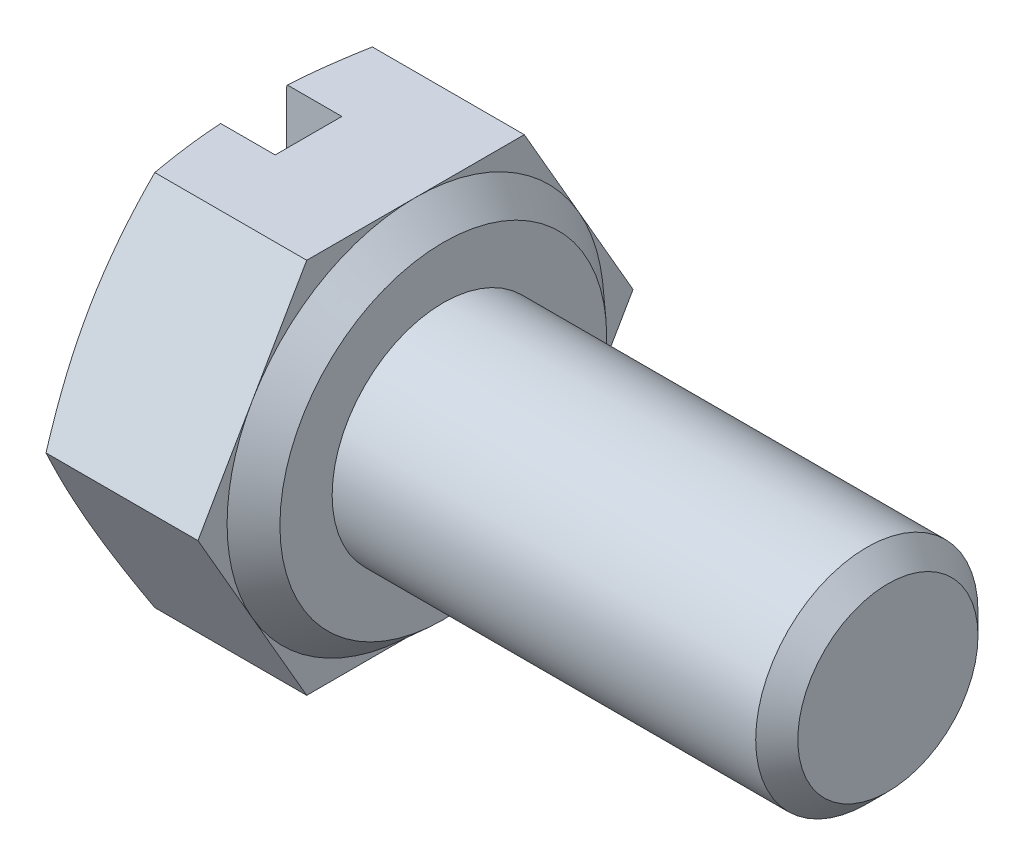
ISO-10303-21;
HEADER;
FILE_DESCRIPTION(('STEP AP214'),'2;1');
FILE_NAME('part.step','',(''),(''),'','','');
FILE_SCHEMA(('AUTOMOTIVE_DESIGN { 1 0 10303 214 1 1 1 1 }'));
ENDSEC;
DATA;
#1=APPLICATION_CONTEXT('core data for automotive mechanical design processes');
#2=APPLICATION_PROTOCOL_DEFINITION('international standard','automotive_design',2000,#1);
#3=PRODUCT_CONTEXT('',#1,'mechanical');
#4=PRODUCT('Part','Part','',(#3));
#5=PRODUCT_RELATED_PRODUCT_CATEGORY('part','',(#4));
#6=PRODUCT_DEFINITION_FORMATION('','',#4);
#7=PRODUCT_DEFINITION_CONTEXT('part definition',#1,'design');
#8=PRODUCT_DEFINITION('design','',#6,#7);
#9=PRODUCT_DEFINITION_SHAPE('','',#8);
#10=(LENGTH_UNIT() NAMED_UNIT(*) SI_UNIT(.MILLI.,.METRE.));
#11=(NAMED_UNIT(*) PLANE_ANGLE_UNIT() SI_UNIT($,.RADIAN.));
#12=(NAMED_UNIT(*) SI_UNIT($,.STERADIAN.) SOLID_ANGLE_UNIT());
#13=UNCERTAINTY_MEASURE_WITH_UNIT(LENGTH_MEASURE(1.E-05),#10,'distance_accuracy_value','');
#14=(GEOMETRIC_REPRESENTATION_CONTEXT(3) GLOBAL_UNCERTAINTY_ASSIGNED_CONTEXT((#13)) GLOBAL_UNIT_ASSIGNED_CONTEXT((#10,
#11,#12)) REPRESENTATION_CONTEXT('',''));
#15=CARTESIAN_POINT('',(0.,0.,0.));
#16=DIRECTION('',(0.,0.,1.));
#17=DIRECTION('',(1.,0.,0.));
#18=AXIS2_PLACEMENT_3D('',#15,#16,#17);
#19=CARTESIAN_POINT('',(0.,-3.39,-1.95721741255283));
#20=DIRECTION('',(1.,0.,0.));
#21=DIRECTION('',(0.,0.,-1.));
#22=AXIS2_PLACEMENT_3D('',#19,#20,#21);
#23=PLANE('',#22);
#24=CARTESIAN_POINT('',(0.,0.,0.));
#25=DIRECTION('',(1.,0.,0.));
#26=DIRECTION('',(0.,0.,-1.));
#27=AXIS2_PLACEMENT_3D('',#24,#25,#26);
#28=CIRCLE('',#27,3.39000000000002);
#29=CARTESIAN_POINT('',(0.,-3.33648018126889,-0.6));
#30=VERTEX_POINT('',#29);
#31=CARTESIAN_POINT('',(0.,-1.69500000000001,-2.93582611882924));
#32=VERTEX_POINT('',#31);
#33=EDGE_CURVE('E312',#30,#32,#28,.T.);
#34=ORIENTED_EDGE('',*,*,#33,.F.);
#35=DIRECTION('',(0.,1.,0.));
#36=VECTOR('',#35,1.);
#37=CARTESIAN_POINT('',(0.,-3.39,-0.6));
#38=LINE('',#37,#36);
#39=CARTESIAN_POINT('',(0.,3.33648018126889,-0.6));
#40=VERTEX_POINT('',#39);
#41=EDGE_CURVE('E11',#30,#40,#38,.T.);
#42=ORIENTED_EDGE('',*,*,#41,.T.);
#43=CARTESIAN_POINT('',(0.,1.69500000000001,-2.93582611882924));
#44=VERTEX_POINT('',#43);
#45=EDGE_CURVE('E310',#44,#40,#28,.T.);
#46=ORIENTED_EDGE('',*,*,#45,.F.);
#47=EDGE_CURVE('E318',#32,#44,#28,.T.);
#48=ORIENTED_EDGE('',*,*,#47,.F.);
#49=EDGE_LOOP('',(#34,#42,#46,#48));
#50=FACE_BOUND('',#49,.T.);
#51=ADVANCED_FACE('F37',(#50),#23,.F.);
#52=CARTESIAN_POINT('',(2.925,-3.39,1.95721741255283));
#53=DIRECTION('',(0.,1.,0.));
#54=DIRECTION('',(0.,0.,1.));
#55=AXIS2_PLACEMENT_3D('',#52,#53,#54);
#56=PLANE('',#55);
#57=DIRECTION('',(0.,0.,-1.));
#58=VECTOR('',#57,1.);
#59=CARTESIAN_POINT('',(1.,-3.39000000000004,0.6));
#60=LINE('',#59,#58);
#61=CARTESIAN_POINT('',(1.,-3.39000000000004,0.6));
#62=VERTEX_POINT('',#61);
#63=CARTESIAN_POINT('',(1.,-3.39000000000004,-0.6));
#64=VERTEX_POINT('',#63);
#65=EDGE_CURVE('E174',#62,#64,#60,.T.);
#66=ORIENTED_EDGE('',*,*,#65,.T.);
#67=DIRECTION('',(-1.,0.,0.));
#68=VECTOR('',#67,1.);
#69=CARTESIAN_POINT('',(1.,-3.39000000000004,-0.6));
#70=LINE('',#69,#68);
#71=CARTESIAN_POINT('',(0.0191768285320485,-3.39000000000004,-0.6));
#72=VERTEX_POINT('',#71);
#73=EDGE_CURVE('E180',#64,#72,#70,.T.);
#74=ORIENTED_EDGE('',*,*,#73,.T.);
#75=CARTESIAN_POINT('',(1.0199798935476,-3.39,-5.18202350349093));
#76=CARTESIAN_POINT('',(0.973277002242215,-3.39,-5.02864764339972));
#77=CARTESIAN_POINT('',(0.927119072876947,-3.39,-4.87510275748852));
#78=CARTESIAN_POINT('',(0.836194610175305,-3.39,-4.56758888202956));
#79=CARTESIAN_POINT('',(0.791428186940748,-3.39,-4.41361985996636));
#80=CARTESIAN_POINT('',(0.703513740136752,-3.39,-4.1049081257591));
#81=CARTESIAN_POINT('',(0.660368891930332,-3.39,-3.9501645060724));
#82=CARTESIAN_POINT('',(0.576202703755948,-3.39,-3.64010163790346));
#83=CARTESIAN_POINT('',(0.535181325660589,-3.39,-3.48478239981027));
#84=CARTESIAN_POINT('',(0.456277437117916,-3.39,-3.17538416295869));
#85=CARTESIAN_POINT('',(0.418362460953622,-3.39,-3.02131348495736));
#86=CARTESIAN_POINT('',(0.345760478621677,-3.39,-2.71240531015016));
#87=CARTESIAN_POINT('',(0.31107352977889,-3.39,-2.55756779977793));
#88=CARTESIAN_POINT('',(0.245736727919532,-3.39,-2.24709331546656));
#89=CARTESIAN_POINT('',(0.215085449738308,-3.39,-2.09145664402713));
#90=CARTESIAN_POINT('',(0.158752150984605,-3.39,-1.7792761387277));
#91=CARTESIAN_POINT('',(0.133070078323603,-3.39,-1.62273231439442));
#92=CARTESIAN_POINT('',(0.0902615531817793,-3.39,-1.32636320569982));
#93=CARTESIAN_POINT('',(0.0724987882413159,-3.39,-1.18663069691262));
#94=CARTESIAN_POINT('',(0.0424324881028078,-3.39,-0.906588669661413));
#95=CARTESIAN_POINT('',(0.0301282534946746,-3.39,-0.766279227447356));
#96=CARTESIAN_POINT('',(0.0115684693108612,-3.39,-0.485347204994709));
#97=CARTESIAN_POINT('',(0.0053089398892289,-3.39,-0.344724891973994));
#98=CARTESIAN_POINT('',(-0.000843430608769452,-3.39,-0.0633395865578644));
#99=CARTESIAN_POINT('',(-0.000736316645797419,-3.39,0.0774234048370721));
#100=CARTESIAN_POINT('',(0.00585535977489844,-3.39,0.359511810579499));
#101=CARTESIAN_POINT('',(0.0123722627973839,-3.39,0.500836456802881));
#102=CARTESIAN_POINT('',(0.0314839573460896,-3.39,0.783070507641816));
#103=CARTESIAN_POINT('',(0.0440788948926778,-3.39,0.923979902199419));
#104=CARTESIAN_POINT('',(0.0747561661274467,-3.39,1.20531451424878));
#105=CARTESIAN_POINT('',(0.0928432130380131,-3.39,1.34573921068273));
#106=CARTESIAN_POINT('',(0.133775937021095,-3.39,1.62588419860851));
#107=CARTESIAN_POINT('',(0.156621639598417,-3.39,1.76560448632082));
#108=CARTESIAN_POINT('',(0.233780310562563,-3.39,2.19842531997452));
#109=CARTESIAN_POINT('',(0.294955955630487,-3.39,2.49029899907323));
#110=CARTESIAN_POINT('',(0.429080881996306,-3.39,3.07133579793216));
#111=CARTESIAN_POINT('',(0.502034403900256,-3.39,3.36049790156761));
#112=CARTESIAN_POINT('',(0.655790287789285,-3.39,3.93710836070669));
#113=CARTESIAN_POINT('',(0.736602683097888,-3.39,4.22455401473235));
#114=CARTESIAN_POINT('',(0.903426263150155,-3.39,4.7978679479515));
#115=CARTESIAN_POINT('',(0.989436623009939,-3.39,5.08373646960918));
#116=CARTESIAN_POINT('',(1.1640850839713,-3.39,5.65121216000974));
#117=CARTESIAN_POINT('',(1.25268370134973,-3.39,5.93283153633285));
#118=CARTESIAN_POINT('',(1.43239756302465,-3.39,6.49527837196229));
#119=CARTESIAN_POINT('',(1.52351292806605,-3.39,6.77610579255846));
#120=CARTESIAN_POINT('',(1.70722886302288,-3.39,7.33609287888207));
#121=CARTESIAN_POINT('',(1.79982248576516,-3.39,7.6152548295592));
#122=CARTESIAN_POINT('',(1.98639802369661,-3.39,8.17308924398154));
#123=CARTESIAN_POINT('',(2.08037982391117,-3.39,8.45176174614945));
#124=CARTESIAN_POINT('',(2.17484728105454,-3.39,8.73026714408878));
#125=B_SPLINE_CURVE_WITH_KNOTS('',3,(#75,#76,#77,#78,#79,#80,#81,#82,#83,#84,#85,#86,#87,#88,
#89,#90,#91,#92,#93,#94,#95,#96,#97,#98,#99,#100,#101,#102,#103,#104,#105,#106,#107,#108,#109,
#110,#111,#112,#113,#114,#115,#116,#117,#118,#119,#120,#121,#122,#123,#124),.UNSPECIFIED.,.F.,
.F.,(4,2,2,2,2,2,2,2,2,2,2,2,2,2,2,2,2,2,2,2,2,2,2,2,4),(0.,0.480989717785644,0.962017397120821,
1.44394255408912,1.92585905497698,2.40183354492129,2.87781648583752,3.35363088376765,
3.82944029381557,4.25191845933479,4.67434247641531,5.09648817867019,5.51863089977051,
5.94291452361966,6.36720834108241,6.79186731337202,7.21652856175053,8.11074113208823,
9.00527638324546,9.90096905563466,10.7965199586566,11.6821858830082,12.5678943726271,
13.4502421784021,14.3325173097535),.UNSPECIFIED.);
#126=CARTESIAN_POINT('',(0.19087866615106,-3.39000000000001,-1.95721741255282));
#127=VERTEX_POINT('',#126);
#128=EDGE_CURVE('E391',#127,#72,#125,.T.);
#129=ORIENTED_EDGE('',*,*,#128,.F.);
#130=DIRECTION('',(-1.,0.,0.));
#131=VECTOR('',#130,1.);
#132=CARTESIAN_POINT('',(2.925,-3.39,-1.95721741255283));
#133=LINE('',#132,#131);
#134=CARTESIAN_POINT('',(2.925,-3.39,-1.95721741255283));
#135=VERTEX_POINT('',#134);
#136=EDGE_CURVE('E332',#135,#127,#133,.T.);
#137=ORIENTED_EDGE('',*,*,#136,.F.);
#138=DIRECTION('',(0.,0.,-1.));
#139=VECTOR('',#138,1.);
#140=CARTESIAN_POINT('',(2.925,-3.39,1.95721741255283));
#141=LINE('',#140,#139);
#142=CARTESIAN_POINT('',(2.925,-3.39,0.));
#143=VERTEX_POINT('',#142);
#144=EDGE_CURVE('E373',#143,#135,#141,.T.);
#145=ORIENTED_EDGE('',*,*,#144,.F.);
#146=CARTESIAN_POINT('',(2.925,-3.39,1.95721741255283));
#147=VERTEX_POINT('',#146);
#148=EDGE_CURVE('E370',#147,#143,#141,.T.);
#149=ORIENTED_EDGE('',*,*,#148,.F.);
#150=DIRECTION('',(-1.,0.,0.));
#151=VECTOR('',#150,1.);
#152=CARTESIAN_POINT('',(2.925,-3.39,1.95721741255283));
#153=LINE('',#152,#151);
#154=CARTESIAN_POINT('',(0.19087866615106,-3.39000000000004,1.95721741255281));
#155=VERTEX_POINT('',#154);
#156=EDGE_CURVE('E348',#147,#155,#153,.T.);
#157=ORIENTED_EDGE('',*,*,#156,.T.);
#158=CARTESIAN_POINT('',(0.0191768285320465,-3.39000000000004,0.6));
#159=VERTEX_POINT('',#158);
#160=EDGE_CURVE('E266',#159,#155,#125,.T.);
#161=ORIENTED_EDGE('',*,*,#160,.F.);
#162=DIRECTION('',(1.,0.,0.));
#163=VECTOR('',#162,1.);
#164=CARTESIAN_POINT('',(0.,-3.39000000000004,0.6));
#165=LINE('',#164,#163);
#166=EDGE_CURVE('E183',#159,#62,#165,.T.);
#167=ORIENTED_EDGE('',*,*,#166,.T.);
#168=EDGE_LOOP('',(#66,#74,#129,#137,#145,#149,#157,#161,#167));
#169=FACE_BOUND('',#168,.T.);
#170=ADVANCED_FACE('F283',(#169),#56,.F.);
#171=CARTESIAN_POINT('',(2.925,-3.39,-1.95721741255283));
#172=DIRECTION('',(0.,0.5,0.866025403784439));
#173=DIRECTION('',(0.,-0.866025403784439,0.5));
#174=AXIS2_PLACEMENT_3D('',#171,#172,#173);
#175=PLANE('',#174);
#176=CARTESIAN_POINT('',(0.190920695673182,0.000200000000001929,-3.9145502951595));
#177=CARTESIAN_POINT('',(0.161404170530895,-0.140203810950532,-3.83348811711196));
#178=CARTESIAN_POINT('',(0.134553686064012,-0.281070641113374,-3.75215861479756));
#179=CARTESIAN_POINT('',(0.0873142945927185,-0.563720316746573,-3.58897074848437));
#180=CARTESIAN_POINT('',(0.0669304448507107,-0.705503791101429,-3.50711202139895));
#181=CARTESIAN_POINT('',(0.0339601092717287,-0.988413133098568,-3.34377423664064));
#182=CARTESIAN_POINT('',(0.0213017035221379,-1.12953253845124,-3.2622989099724));
#183=CARTESIAN_POINT('',(0.00432321252371425,-1.41210139168608,-3.09915770649266));
#184=CARTESIAN_POINT('',(0.,-1.55355069584304,-3.01749191266095));
#185=CARTESIAN_POINT('',(0.,-1.83644930415696,-2.85416032499754));
#186=CARTESIAN_POINT('',(0.00432321252371371,-1.97789860831391,-2.77249453116584));
#187=CARTESIAN_POINT('',(0.0213017035221368,-2.26046746154876,-2.6093533276861));
#188=CARTESIAN_POINT('',(0.0339601092717272,-2.40158686690143,-2.52787800101785));
#189=CARTESIAN_POINT('',(0.0669304448507088,-2.68449620889857,-2.36454021625954));
#190=CARTESIAN_POINT('',(0.0873142945927163,-2.82627968325342,-2.28268148917413));
#191=CARTESIAN_POINT('',(0.13455368606401,-3.10892935888662,-2.11949362286094));
#192=CARTESIAN_POINT('',(0.161404170530892,-3.24979618904946,-2.03816412054653));
#193=CARTESIAN_POINT('',(0.190920695673179,-3.3902,-1.95710194249899));
#194=B_SPLINE_CURVE_WITH_KNOTS('',3,(#176,#177,#178,#179,#180,#181,#182,#183,#184,#185,#186,
#187,#188,#189,#190,#191,#192,#193),.UNSPECIFIED.,.F.,.F.,(4,2,2,2,2,2,2,2,4),(0.,
0.494419076649432,0.989223868307329,1.47934907283627,1.96929035184584,2.45923163085541,
2.94935683538435,3.44416162704224,3.93858070369168),.UNSPECIFIED.);
#195=CARTESIAN_POINT('',(0.190878666151059,0.,-3.91443482510566));
#196=VERTEX_POINT('',#195);
#197=EDGE_CURVE('E274',#196,#32,#194,.T.);
#198=ORIENTED_EDGE('',*,*,#197,.F.);
#199=DIRECTION('',(-1.,0.,0.));
#200=VECTOR('',#199,1.);
#201=CARTESIAN_POINT('',(2.925,0.,-3.91443482510566));
#202=LINE('',#201,#200);
#203=CARTESIAN_POINT('',(2.925,0.,-3.91443482510566));
#204=VERTEX_POINT('',#203);
#205=EDGE_CURVE('E336',#204,#196,#202,.T.);
#206=ORIENTED_EDGE('',*,*,#205,.F.);
#207=DIRECTION('',(0.,0.866025403784439,-0.5));
#208=VECTOR('',#207,1.);
#209=CARTESIAN_POINT('',(2.925,-3.39,-1.95721741255283));
#210=LINE('',#209,#208);
#211=CARTESIAN_POINT('',(2.925,-1.695,-2.93582611882923));
#212=VERTEX_POINT('',#211);
#213=EDGE_CURVE('E369',#212,#204,#210,.T.);
#214=ORIENTED_EDGE('',*,*,#213,.F.);
#215=EDGE_CURVE('E366',#135,#212,#210,.T.);
#216=ORIENTED_EDGE('',*,*,#215,.F.);
#217=ORIENTED_EDGE('',*,*,#136,.T.);
#218=EDGE_CURVE('E263',#32,#127,#194,.T.);
#219=ORIENTED_EDGE('',*,*,#218,.F.);
#220=EDGE_LOOP('',(#198,#206,#214,#216,#217,#219));
#221=FACE_BOUND('',#220,.T.);
#222=ADVANCED_FACE('F280',(#221),#175,.F.);
#223=CARTESIAN_POINT('',(2.925,0.,-3.91443482510566));
#224=DIRECTION('',(0.,-0.5,0.866025403784438));
#225=DIRECTION('',(0.,-0.866025403784438,-0.5));
#226=AXIS2_PLACEMENT_3D('',#223,#224,#225);
#227=PLANE('',#226);
#228=CARTESIAN_POINT('',(0.190920695673179,3.3902,-1.95710194249899));
#229=CARTESIAN_POINT('',(0.161404170530892,3.24979618904947,-2.03816412054653));
#230=CARTESIAN_POINT('',(0.13455368606401,3.10892935888663,-2.11949362286094));
#231=CARTESIAN_POINT('',(0.0873142945927164,2.82627968325343,-2.28268148917413));
#232=CARTESIAN_POINT('',(0.0669304448507088,2.68449620889857,-2.36454021625954));
#233=CARTESIAN_POINT('',(0.0339601092717272,2.40158686690143,-2.52787800101785));
#234=CARTESIAN_POINT('',(0.0213017035221369,2.26046746154876,-2.6093533276861));
#235=CARTESIAN_POINT('',(0.00432321252371387,1.97789860831392,-2.77249453116584));
#236=CARTESIAN_POINT('',(0.,1.83644930415696,-2.85416032499754));
#237=CARTESIAN_POINT('',(0.,1.55355069584304,-3.01749191266095));
#238=CARTESIAN_POINT('',(0.00432321252371453,1.41210139168609,-3.09915770649266));
#239=CARTESIAN_POINT('',(0.0213017035221382,1.12953253845124,-3.2622989099724));
#240=CARTESIAN_POINT('',(0.0339601092717288,0.988413133098571,-3.34377423664064));
#241=CARTESIAN_POINT('',(0.0669304448507108,0.705503791101433,-3.50711202139895));
#242=CARTESIAN_POINT('',(0.0873142945927185,0.563720316746576,-3.58897074848437));
#243=CARTESIAN_POINT('',(0.134553686064012,0.281070641113378,-3.75215861479756));
#244=CARTESIAN_POINT('',(0.161404170530895,0.140203810950536,-3.83348811711196));
#245=CARTESIAN_POINT('',(0.190920695673182,-0.000199999999998229,-3.9145502951595));
#246=B_SPLINE_CURVE_WITH_KNOTS('',3,(#228,#229,#230,#231,#232,#233,#234,#235,#236,#237,#238,
#239,#240,#241,#242,#243,#244,#245),.UNSPECIFIED.,.F.,.F.,(4,2,2,2,2,2,2,2,4),(0.,
0.494419076649432,0.98922386830733,1.47934907283627,1.96929035184584,2.45923163085541,
2.94935683538435,3.44416162704224,3.93858070369168),.UNSPECIFIED.);
#247=CARTESIAN_POINT('',(0.19087866615106,3.39,-1.95721741255285));
#248=VERTEX_POINT('',#247);
#249=EDGE_CURVE('E314',#248,#44,#246,.T.);
#250=ORIENTED_EDGE('',*,*,#249,.F.);
#251=DIRECTION('',(-1.,0.,0.));
#252=VECTOR('',#251,1.);
#253=CARTESIAN_POINT('',(2.925,3.39,-1.95721741255283));
#254=LINE('',#253,#252);
#255=CARTESIAN_POINT('',(2.925,3.39,-1.95721741255283));
#256=VERTEX_POINT('',#255);
#257=EDGE_CURVE('E339',#256,#248,#254,.T.);
#258=ORIENTED_EDGE('',*,*,#257,.F.);
#259=DIRECTION('',(0.,0.866025403784438,0.5));
#260=VECTOR('',#259,1.);
#261=CARTESIAN_POINT('',(2.925,0.,-3.91443482510566));
#262=LINE('',#261,#260);
#263=CARTESIAN_POINT('',(2.925,1.695,-2.93582611882923));
#264=VERTEX_POINT('',#263);
#265=EDGE_CURVE('E365',#264,#256,#262,.T.);
#266=ORIENTED_EDGE('',*,*,#265,.F.);
#267=EDGE_CURVE('E362',#204,#264,#262,.T.);
#268=ORIENTED_EDGE('',*,*,#267,.F.);
#269=ORIENTED_EDGE('',*,*,#205,.T.);
#270=EDGE_CURVE('E275',#44,#196,#246,.T.);
#271=ORIENTED_EDGE('',*,*,#270,.F.);
#272=EDGE_LOOP('',(#250,#258,#266,#268,#269,#271));
#273=FACE_BOUND('',#272,.T.);
#274=ADVANCED_FACE('F254',(#273),#227,.F.);
#275=CARTESIAN_POINT('',(2.925,3.39,-1.95721741255283));
#276=DIRECTION('',(0.,-1.,0.));
#277=DIRECTION('',(0.,0.,-1.));
#278=AXIS2_PLACEMENT_3D('',#275,#276,#277);
#279=PLANE('',#278);
#280=CARTESIAN_POINT('',(1.0199798935476,3.39,-5.18202350349093));
#281=CARTESIAN_POINT('',(0.973277002242215,3.39,-5.02864764339972));
#282=CARTESIAN_POINT('',(0.927119072876947,3.39,-4.87510275748851));
#283=CARTESIAN_POINT('',(0.836194610175304,3.39,-4.56758888202956));
#284=CARTESIAN_POINT('',(0.791428186940747,3.39,-4.41361985996636));
#285=CARTESIAN_POINT('',(0.703513740136751,3.39,-4.1049081257591));
#286=CARTESIAN_POINT('',(0.660368891930331,3.39,-3.9501645060724));
#287=CARTESIAN_POINT('',(0.576202703755947,3.39,-3.64010163790345));
#288=CARTESIAN_POINT('',(0.535181325660588,3.39,-3.48478239981026));
#289=CARTESIAN_POINT('',(0.456277437117916,3.39,-3.17538416295869));
#290=CARTESIAN_POINT('',(0.418362460953622,3.39,-3.02131348495735));
#291=CARTESIAN_POINT('',(0.345760478621677,3.39,-2.71240531015016));
#292=CARTESIAN_POINT('',(0.31107352977889,3.39,-2.55756779977793));
#293=CARTESIAN_POINT('',(0.245736727919532,3.39,-2.24709331546656));
#294=CARTESIAN_POINT('',(0.215085449738308,3.39,-2.09145664402713));
#295=CARTESIAN_POINT('',(0.158752150984605,3.39,-1.7792761387277));
#296=CARTESIAN_POINT('',(0.133070078323604,3.39,-1.62273231439442));
#297=CARTESIAN_POINT('',(0.0902615531817794,3.39,-1.32636320569982));
#298=CARTESIAN_POINT('',(0.072498788241316,3.39,-1.18663069691261));
#299=CARTESIAN_POINT('',(0.0424324881028079,3.39,-0.90658866966141));
#300=CARTESIAN_POINT('',(0.0301282534946748,3.39,-0.766279227447353));
#301=CARTESIAN_POINT('',(0.0115684693108616,3.39,-0.485347204994706));
#302=CARTESIAN_POINT('',(0.00530893988922932,3.39,-0.344724891973991));
#303=CARTESIAN_POINT('',(-0.000843430608769069,3.39,-0.0633395865578616));
#304=CARTESIAN_POINT('',(-0.000736316645797097,3.39,0.077423404837075));
#305=CARTESIAN_POINT('',(0.00585535977489889,3.39,0.359511810579502));
#306=CARTESIAN_POINT('',(0.0123722627973845,3.39,0.500836456802884));
#307=CARTESIAN_POINT('',(0.0314839573460904,3.39,0.783070507641819));
#308=CARTESIAN_POINT('',(0.0440788948926785,3.39,0.923979902199422));
#309=CARTESIAN_POINT('',(0.0747561661274475,3.39,1.20531451424878));
#310=CARTESIAN_POINT('',(0.0928432130380141,3.39,1.34573921068274));
#311=CARTESIAN_POINT('',(0.133775937021096,3.39,1.62588419860851));
#312=CARTESIAN_POINT('',(0.156621639598417,3.39,1.76560448632083));
#313=CARTESIAN_POINT('',(0.233780310562564,3.39,2.19842531997453));
#314=CARTESIAN_POINT('',(0.294955955630488,3.39,2.49029899907324));
#315=CARTESIAN_POINT('',(0.429080881996308,3.39,3.07133579793217));
#316=CARTESIAN_POINT('',(0.502034403900258,3.39,3.36049790156762));
#317=CARTESIAN_POINT('',(0.655790287789287,3.39,3.9371083607067));
#318=CARTESIAN_POINT('',(0.73660268309789,3.39,4.22455401473236));
#319=CARTESIAN_POINT('',(0.903426263150158,3.39,4.79786794795151));
#320=CARTESIAN_POINT('',(0.989436623009942,3.39,5.08373646960919));
#321=CARTESIAN_POINT('',(1.1640850839713,3.39,5.65121216000975));
#322=CARTESIAN_POINT('',(1.25268370134973,3.39,5.93283153633286));
#323=CARTESIAN_POINT('',(1.43239756302465,3.39,6.4952783719623));
#324=CARTESIAN_POINT('',(1.52351292806605,3.39,6.77610579255847));
#325=CARTESIAN_POINT('',(1.70722886302288,3.39,7.33609287888208));
#326=CARTESIAN_POINT('',(1.79982248576516,3.39,7.6152548295592));
#327=CARTESIAN_POINT('',(1.98639802369661,3.39,8.17308924398155));
#328=CARTESIAN_POINT('',(2.08037982391118,3.39,8.45176174614945));
#329=CARTESIAN_POINT('',(2.17484728105454,3.39,8.73026714408879));
#330=B_SPLINE_CURVE_WITH_KNOTS('',3,(#280,#281,#282,#283,#284,#285,#286,#287,#288,#289,#290,
#291,#292,#293,#294,#295,#296,#297,#298,#299,#300,#301,#302,#303,#304,#305,#306,#307,#308,#309,
#310,#311,#312,#313,#314,#315,#316,#317,#318,#319,#320,#321,#322,#323,#324,#325,#326,#327,#328,
#329),.UNSPECIFIED.,.F.,.F.,(4,2,2,2,2,2,2,2,2,2,2,2,2,2,2,2,2,2,2,2,2,2,2,2,4),(0.,
0.480989717785644,0.962017397120823,1.44394255408912,1.92585905497698,2.40183354492129,
2.87781648583752,3.35363088376766,3.82944029381558,4.2519184593348,4.67434247641531,
5.09648817867019,5.51863089977051,5.94291452361966,6.36720834108241,6.79186731337203,
7.21652856175053,8.11074113208823,9.00527638324547,9.90096905563467,10.7965199586566,
11.6821858830082,12.5678943726271,13.4502421784021,14.3325173097535),.UNSPECIFIED.);
#331=CARTESIAN_POINT('',(0.0191768285320479,3.39000000000004,-0.6));
#332=VERTEX_POINT('',#331);
#333=EDGE_CURVE('E265',#332,#248,#330,.F.);
#334=ORIENTED_EDGE('',*,*,#333,.F.);
#335=DIRECTION('',(-1.,0.,0.));
#336=VECTOR('',#335,1.);
#337=CARTESIAN_POINT('',(1.,3.39000000000004,-0.6));
#338=LINE('',#337,#336);
#339=CARTESIAN_POINT('',(1.,3.39000000000004,-0.6));
#340=VERTEX_POINT('',#339);
#341=EDGE_CURVE('E167',#340,#332,#338,.T.);
#342=ORIENTED_EDGE('',*,*,#341,.F.);
#343=DIRECTION('',(0.,0.,-1.));
#344=VECTOR('',#343,1.);
#345=CARTESIAN_POINT('',(1.,3.39000000000004,0.6));
#346=LINE('',#345,#344);
#347=CARTESIAN_POINT('',(1.,3.39000000000004,0.6));
#348=VERTEX_POINT('',#347);
#349=EDGE_CURVE('E166',#348,#340,#346,.T.);
#350=ORIENTED_EDGE('',*,*,#349,.F.);
#351=DIRECTION('',(1.,0.,0.));
#352=VECTOR('',#351,1.);
#353=CARTESIAN_POINT('',(0.,3.39000000000004,0.6));
#354=LINE('',#353,#352);
#355=CARTESIAN_POINT('',(0.0191768285320459,3.39000000000004,0.6));
#356=VERTEX_POINT('',#355);
#357=EDGE_CURVE('E155',#356,#348,#354,.T.);
#358=ORIENTED_EDGE('',*,*,#357,.F.);
#359=CARTESIAN_POINT('',(0.19087866615106,3.39000000000004,1.95721741255281));
#360=VERTEX_POINT('',#359);
#361=EDGE_CURVE('E258',#360,#356,#330,.F.);
#362=ORIENTED_EDGE('',*,*,#361,.F.);
#363=DIRECTION('',(-1.,0.,0.));
#364=VECTOR('',#363,1.);
#365=CARTESIAN_POINT('',(2.925,3.39,1.95721741255283));
#366=LINE('',#365,#364);
#367=CARTESIAN_POINT('',(2.925,3.39,1.95721741255283));
#368=VERTEX_POINT('',#367);
#369=EDGE_CURVE('E342',#368,#360,#366,.T.);
#370=ORIENTED_EDGE('',*,*,#369,.F.);
#371=DIRECTION('',(0.,0.,1.));
#372=VECTOR('',#371,1.);
#373=CARTESIAN_POINT('',(2.925,3.39,-1.95721741255283));
#374=LINE('',#373,#372);
#375=CARTESIAN_POINT('',(2.925,3.39,0.));
#376=VERTEX_POINT('',#375);
#377=EDGE_CURVE('E361',#376,#368,#374,.T.);
#378=ORIENTED_EDGE('',*,*,#377,.F.);
#379=EDGE_CURVE('E358',#256,#376,#374,.T.);
#380=ORIENTED_EDGE('',*,*,#379,.F.);
#381=ORIENTED_EDGE('',*,*,#257,.T.);
#382=EDGE_LOOP('',(#334,#342,#350,#358,#362,#370,#378,#380,#381));
#383=FACE_BOUND('',#382,.T.);
#384=ADVANCED_FACE('F179',(#383),#279,.F.);
#385=CARTESIAN_POINT('',(2.925,3.39,1.95721741255283));
#386=DIRECTION('',(0.,-0.5,-0.866025403784439));
#387=DIRECTION('',(0.,0.866025403784439,-0.5));
#388=AXIS2_PLACEMENT_3D('',#385,#386,#387);
#389=PLANE('',#388);
#390=CARTESIAN_POINT('',(0.190920695673171,-0.000199999999999249,3.9145502951595));
#391=CARTESIAN_POINT('',(0.161404170530884,0.140203810950535,3.83348811711196));
#392=CARTESIAN_POINT('',(0.134553686064001,0.281070641113376,3.75215861479755));
#393=CARTESIAN_POINT('',(0.0873142945927072,0.563720316746575,3.58897074848437));
#394=CARTESIAN_POINT('',(0.0669304448506995,0.705503791101432,3.50711202139895));
#395=CARTESIAN_POINT('',(0.0339601092717177,0.988413133098571,3.34377423664064));
#396=CARTESIAN_POINT('',(0.0213017035221272,1.12953253845124,3.2622989099724));
#397=CARTESIAN_POINT('',(0.00432321252370407,1.41210139168609,3.09915770649266));
#398=CARTESIAN_POINT('',(0.,1.55355069584304,3.01749191266095));
#399=CARTESIAN_POINT('',(0.,1.83644930415696,2.85416032499754));
#400=CARTESIAN_POINT('',(0.00432321252370457,1.97789860831392,2.77249453116584));
#401=CARTESIAN_POINT('',(0.0213017035221284,2.26046746154876,2.6093533276861));
#402=CARTESIAN_POINT('',(0.0339601092717192,2.40158686690143,2.52787800101785));
#403=CARTESIAN_POINT('',(0.0669304448507015,2.68449620889857,2.36454021625954));
#404=CARTESIAN_POINT('',(0.0873142945927094,2.82627968325343,2.28268148917413));
#405=CARTESIAN_POINT('',(0.134553686064004,3.10892935888663,2.11949362286094));
#406=CARTESIAN_POINT('',(0.161404170530887,3.24979618904947,2.03816412054653));
#407=CARTESIAN_POINT('',(0.190920695673174,3.3902,1.95710194249899));
#408=B_SPLINE_CURVE_WITH_KNOTS('',3,(#390,#391,#392,#393,#394,#395,#396,#397,#398,#399,#400,
#401,#402,#403,#404,#405,#406,#407),.UNSPECIFIED.,.F.,.F.,(4,2,2,2,2,2,2,2,4),(0.,
0.494419076649432,0.98922386830733,1.47934907283627,1.96929035184584,2.45923163085541,
2.94935683538435,3.44416162704224,3.93858070369168),.UNSPECIFIED.);
#409=CARTESIAN_POINT('',(0.19087866615106,0.,3.9144348251057));
#410=VERTEX_POINT('',#409);
#411=CARTESIAN_POINT('',(0.,1.69500000000001,2.93582611882928));
#412=VERTEX_POINT('',#411);
#413=EDGE_CURVE('E60',#410,#412,#408,.T.);
#414=ORIENTED_EDGE('',*,*,#413,.F.);
#415=DIRECTION('',(-1.,0.,0.));
#416=VECTOR('',#415,1.);
#417=CARTESIAN_POINT('',(2.925,0.,3.91443482510566));
#418=LINE('',#417,#416);
#419=CARTESIAN_POINT('',(2.925,0.,3.91443482510566));
#420=VERTEX_POINT('',#419);
#421=EDGE_CURVE('E345',#420,#410,#418,.T.);
#422=ORIENTED_EDGE('',*,*,#421,.F.);
#423=DIRECTION('',(0.,-0.866025403784439,0.5));
#424=VECTOR('',#423,1.);
#425=CARTESIAN_POINT('',(2.925,3.39,1.95721741255283));
#426=LINE('',#425,#424);
#427=CARTESIAN_POINT('',(2.925,1.69499999999999,2.93582611882925));
#428=VERTEX_POINT('',#427);
#429=EDGE_CURVE('E357',#428,#420,#426,.T.);
#430=ORIENTED_EDGE('',*,*,#429,.F.);
#431=EDGE_CURVE('E354',#368,#428,#426,.T.);
#432=ORIENTED_EDGE('',*,*,#431,.F.);
#433=ORIENTED_EDGE('',*,*,#369,.T.);
#434=EDGE_CURVE('E264',#412,#360,#408,.T.);
#435=ORIENTED_EDGE('',*,*,#434,.F.);
#436=EDGE_LOOP('',(#414,#422,#430,#432,#433,#435));
#437=FACE_BOUND('',#436,.T.);
#438=ADVANCED_FACE('F244',(#437),#389,.F.);
#439=CARTESIAN_POINT('',(2.925,0.,3.91443482510566));
#440=DIRECTION('',(0.,0.5,-0.866025403784438));
#441=DIRECTION('',(0.,0.866025403784439,0.5));
#442=AXIS2_PLACEMENT_3D('',#439,#440,#441);
#443=PLANE('',#442);
#444=CARTESIAN_POINT('',(0.190920695673173,-3.3902,1.95710194249899));
#445=CARTESIAN_POINT('',(0.161404170530886,-3.24979618904947,2.03816412054653));
#446=CARTESIAN_POINT('',(0.134553686064003,-3.10892935888662,2.11949362286094));
#447=CARTESIAN_POINT('',(0.0873142945927088,-2.82627968325342,2.28268148917413));
#448=CARTESIAN_POINT('',(0.0669304448507009,-2.68449620889857,2.36454021625954));
#449=CARTESIAN_POINT('',(0.0339601092717186,-2.40158686690143,2.52787800101785));
#450=CARTESIAN_POINT('',(0.0213017035221278,-2.26046746154876,2.6093533276861));
#451=CARTESIAN_POINT('',(0.0043232125237039,-1.97789860831391,2.77249453116584));
#452=CARTESIAN_POINT('',(0.,-1.83644930415696,2.85416032499754));
#453=CARTESIAN_POINT('',(0.,-1.55355069584304,3.01749191266095));
#454=CARTESIAN_POINT('',(0.00432321252370362,-1.41210139168608,3.09915770649266));
#455=CARTESIAN_POINT('',(0.021301703522127,-1.12953253845124,3.2622989099724));
#456=CARTESIAN_POINT('',(0.0339601092717175,-0.988413133098569,3.34377423664064));
#457=CARTESIAN_POINT('',(0.0669304448506993,-0.70550379110143,3.50711202139895));
#458=CARTESIAN_POINT('',(0.0873142945927072,-0.563720316746573,3.58897074848437));
#459=CARTESIAN_POINT('',(0.134553686064001,-0.281070641113375,3.75215861479755));
#460=CARTESIAN_POINT('',(0.161404170530884,-0.140203810950533,3.83348811711196));
#461=CARTESIAN_POINT('',(0.190920695673171,0.000200000000000978,3.9145502951595));
#462=B_SPLINE_CURVE_WITH_KNOTS('',3,(#444,#445,#446,#447,#448,#449,#450,#451,#452,#453,#454,
#455,#456,#457,#458,#459,#460,#461),.UNSPECIFIED.,.F.,.F.,(4,2,2,2,2,2,2,2,4),(0.,
0.494419076649433,0.98922386830733,1.47934907283627,1.96929035184584,2.45923163085541,
2.94935683538435,3.44416162704225,3.93858070369168),.UNSPECIFIED.);
#463=CARTESIAN_POINT('',(0.,-1.69499999999999,2.93582611882925));
#464=VERTEX_POINT('',#463);
#465=EDGE_CURVE('E233',#155,#464,#462,.T.);
#466=ORIENTED_EDGE('',*,*,#465,.F.);
#467=ORIENTED_EDGE('',*,*,#156,.F.);
#468=DIRECTION('',(0.,-0.866025403784438,-0.5));
#469=VECTOR('',#468,1.);
#470=CARTESIAN_POINT('',(2.925,0.,3.91443482510566));
#471=LINE('',#470,#469);
#472=CARTESIAN_POINT('',(2.925,-1.695,2.93582611882926));
#473=VERTEX_POINT('',#472);
#474=EDGE_CURVE('E353',#473,#147,#471,.T.);
#475=ORIENTED_EDGE('',*,*,#474,.F.);
#476=EDGE_CURVE('E350',#420,#473,#471,.T.);
#477=ORIENTED_EDGE('',*,*,#476,.F.);
#478=ORIENTED_EDGE('',*,*,#421,.T.);
#479=EDGE_CURVE('E227',#464,#410,#462,.T.);
#480=ORIENTED_EDGE('',*,*,#479,.F.);
#481=EDGE_LOOP('',(#466,#467,#475,#477,#478,#480));
#482=FACE_BOUND('',#481,.T.);
#483=ADVANCED_FACE('F239',(#482),#443,.F.);
#484=CARTESIAN_POINT('',(3.425,0.,0.));
#485=DIRECTION('',(1.,0.,0.));
#486=DIRECTION('',(0.,0.,-1.));
#487=AXIS2_PLACEMENT_3D('',#484,#485,#486);
#488=PLANE('',#487);
#489=CARTESIAN_POINT('',(3.425,0.,0.));
#490=DIRECTION('',(-1.,0.,0.));
#491=DIRECTION('',(0.,0.,1.));
#492=AXIS2_PLACEMENT_3D('',#489,#490,#491);
#493=CIRCLE('',#492,2.94);
#494=CARTESIAN_POINT('',(3.425,0.,2.94000000000002));
#495=VERTEX_POINT('',#494);
#496=EDGE_CURVE('E374',#495,#495,#493,.T.);
#497=ORIENTED_EDGE('',*,*,#496,.F.);
#498=EDGE_LOOP('',(#497));
#499=FACE_BOUND('',#498,.T.);
#500=CARTESIAN_POINT('',(3.425,0.,0.));
#501=DIRECTION('',(1.,0.,0.));
#502=DIRECTION('',(0.,0.,-1.));
#503=AXIS2_PLACEMENT_3D('',#500,#501,#502);
#504=CIRCLE('',#503,2.);
#505=CARTESIAN_POINT('',(3.425,0.,-2.));
#506=VERTEX_POINT('',#505);
#507=EDGE_CURVE('E380',#506,#506,#504,.T.);
#508=ORIENTED_EDGE('',*,*,#507,.F.);
#509=EDGE_LOOP('',(#508));
#510=FACE_BOUND('',#509,.T.);
#511=ADVANCED_FACE('F243',(#499,#510),#488,.T.);
#512=CARTESIAN_POINT('',(2.925,-3.39,-1.95721741255283));
#513=DIRECTION('',(1.,0.,0.));
#514=DIRECTION('',(0.,0.,-1.));
#515=AXIS2_PLACEMENT_3D('',#512,#513,#514);
#516=PLANE('',#515);
#517=ORIENTED_EDGE('',*,*,#431,.T.);
#518=CARTESIAN_POINT('',(2.925,0.,0.));
#519=DIRECTION('',(-1.,0.,0.));
#520=DIRECTION('',(0.,0.,1.));
#521=AXIS2_PLACEMENT_3D('',#518,#519,#520);
#522=CIRCLE('',#521,3.39);
#523=EDGE_CURVE('E378',#428,#376,#522,.T.);
#524=ORIENTED_EDGE('',*,*,#523,.T.);
#525=ORIENTED_EDGE('',*,*,#377,.T.);
#526=EDGE_LOOP('',(#517,#524,#525));
#527=FACE_BOUND('',#526,.T.);
#528=ADVANCED_FACE('F408',(#527),#516,.T.);
#529=ORIENTED_EDGE('',*,*,#379,.T.);
#530=EDGE_CURVE('E329',#376,#264,#522,.T.);
#531=ORIENTED_EDGE('',*,*,#530,.T.);
#532=ORIENTED_EDGE('',*,*,#265,.T.);
#533=EDGE_LOOP('',(#529,#531,#532));
#534=FACE_BOUND('',#533,.T.);
#535=ADVANCED_FACE('F428',(#534),#516,.T.);
#536=ORIENTED_EDGE('',*,*,#267,.T.);
#537=EDGE_CURVE('E421',#264,#212,#522,.T.);
#538=ORIENTED_EDGE('',*,*,#537,.T.);
#539=ORIENTED_EDGE('',*,*,#213,.T.);
#540=EDGE_LOOP('',(#536,#538,#539));
#541=FACE_BOUND('',#540,.T.);
#542=ADVANCED_FACE('F432',(#541),#516,.T.);
#543=ORIENTED_EDGE('',*,*,#215,.T.);
#544=EDGE_CURVE('E417',#212,#143,#522,.T.);
#545=ORIENTED_EDGE('',*,*,#544,.T.);
#546=ORIENTED_EDGE('',*,*,#144,.T.);
#547=EDGE_LOOP('',(#543,#545,#546));
#548=FACE_BOUND('',#547,.T.);
#549=ADVANCED_FACE('F433',(#548),#516,.T.);
#550=ORIENTED_EDGE('',*,*,#148,.T.);
#551=EDGE_CURVE('E416',#143,#473,#522,.T.);
#552=ORIENTED_EDGE('',*,*,#551,.T.);
#553=ORIENTED_EDGE('',*,*,#474,.T.);
#554=EDGE_LOOP('',(#550,#552,#553));
#555=FACE_BOUND('',#554,.T.);
#556=ADVANCED_FACE('F435',(#555),#516,.T.);
#557=ORIENTED_EDGE('',*,*,#476,.T.);
#558=EDGE_CURVE('E335',#473,#428,#522,.T.);
#559=ORIENTED_EDGE('',*,*,#558,.T.);
#560=ORIENTED_EDGE('',*,*,#429,.T.);
#561=EDGE_LOOP('',(#557,#559,#560));
#562=FACE_BOUND('',#561,.T.);
#563=ADVANCED_FACE('F415',(#562),#516,.T.);
#564=CARTESIAN_POINT('',(2.925,0.,0.));
#565=DIRECTION('',(-1.,0.,0.));
#566=DIRECTION('',(0.,0.,1.));
#567=AXIS2_PLACEMENT_3D('',#564,#565,#566);
#568=CONICAL_SURFACE('',#567,3.39,0.732815101786506);
#569=ORIENTED_EDGE('',*,*,#496,.T.);
#570=EDGE_LOOP('',(#569));
#571=FACE_BOUND('',#570,.T.);
#572=ORIENTED_EDGE('',*,*,#523,.F.);
#573=ORIENTED_EDGE('',*,*,#558,.F.);
#574=ORIENTED_EDGE('',*,*,#551,.F.);
#575=ORIENTED_EDGE('',*,*,#544,.F.);
#576=ORIENTED_EDGE('',*,*,#537,.F.);
#577=ORIENTED_EDGE('',*,*,#530,.F.);
#578=EDGE_LOOP('',(#572,#573,#574,#575,#576,#577));
#579=FACE_BOUND('',#578,.T.);
#580=ADVANCED_FACE('F411',(#571,#579),#568,.T.);
#581=CARTESIAN_POINT('',(11.425,0.,0.));
#582=DIRECTION('',(-1.,0.,0.));
#583=DIRECTION('',(0.,0.,1.));
#584=AXIS2_PLACEMENT_3D('',#581,#582,#583);
#585=CYLINDRICAL_SURFACE('',#584,2.);
#586=CARTESIAN_POINT('',(11.046,0.,0.));
#587=DIRECTION('',(1.,0.,0.));
#588=DIRECTION('',(0.,0.,-1.));
#589=AXIS2_PLACEMENT_3D('',#586,#587,#588);
#590=CIRCLE('',#589,2.);
#591=CARTESIAN_POINT('',(11.046,0.,-2.));
#592=VERTEX_POINT('',#591);
#593=EDGE_CURVE('E322',#592,#592,#590,.F.);
#594=ORIENTED_EDGE('',*,*,#593,.T.);
#595=EDGE_LOOP('',(#594));
#596=FACE_BOUND('',#595,.T.);
#597=ORIENTED_EDGE('',*,*,#507,.T.);
#598=EDGE_LOOP('',(#597));
#599=FACE_BOUND('',#598,.T.);
#600=ADVANCED_FACE('F448',(#596,#599),#585,.T.);
#601=CARTESIAN_POINT('',(11.425,0.,0.));
#602=DIRECTION('',(1.,0.,0.));
#603=DIRECTION('',(0.,0.,-1.));
#604=AXIS2_PLACEMENT_3D('',#601,#602,#603);
#605=PLANE('',#604);
#606=CARTESIAN_POINT('',(11.425,0.,0.));
#607=DIRECTION('',(1.,0.,0.));
#608=DIRECTION('',(0.,0.,-1.));
#609=AXIS2_PLACEMENT_3D('',#606,#607,#608);
#610=CIRCLE('',#609,1.621);
#611=CARTESIAN_POINT('',(11.425,0.,-1.621));
#612=VERTEX_POINT('',#611);
#613=EDGE_CURVE('E325',#612,#612,#610,.T.);
#614=ORIENTED_EDGE('',*,*,#613,.T.);
#615=EDGE_LOOP('',(#614));
#616=FACE_BOUND('',#615,.T.);
#617=ADVANCED_FACE('F451',(#616),#605,.T.);
#618=CARTESIAN_POINT('',(11.425,0.,0.));
#619=DIRECTION('',(-1.,0.,0.));
#620=DIRECTION('',(0.,0.,1.));
#621=AXIS2_PLACEMENT_3D('',#618,#619,#620);
#622=CONICAL_SURFACE('',#621,1.621,0.785398163397449);
#623=ORIENTED_EDGE('',*,*,#593,.F.);
#624=EDGE_LOOP('',(#623));
#625=FACE_BOUND('',#624,.T.);
#626=ORIENTED_EDGE('',*,*,#613,.F.);
#627=EDGE_LOOP('',(#626));
#628=FACE_BOUND('',#627,.T.);
#629=ADVANCED_FACE('F39',(#625,#628),#622,.T.);
#630=CARTESIAN_POINT('',(0.,0.,0.));
#631=DIRECTION('',(1.,0.,0.));
#632=DIRECTION('',(0.,0.,-1.));
#633=AXIS2_PLACEMENT_3D('',#630,#631,#632);
#634=CONICAL_SURFACE('',#633,3.39000000000002,1.22173047639603);
#635=ORIENTED_EDGE('',*,*,#270,.T.);
#636=ORIENTED_EDGE('',*,*,#197,.T.);
#637=ORIENTED_EDGE('',*,*,#47,.T.);
#638=EDGE_LOOP('',(#635,#636,#637));
#639=FACE_BOUND('',#638,.T.);
#640=ADVANCED_FACE('F385',(#639),#634,.T.);
#641=CARTESIAN_POINT('',(-0.994239095418175,-0.270971267826587,-0.6));
#642=CARTESIAN_POINT('',(-0.990016222311107,-0.299147806050525,-0.6));
#643=CARTESIAN_POINT('',(-0.985263203080746,-0.32723802483912,-0.6));
#644=CARTESIAN_POINT('',(-0.974877954707277,-0.383246060839802,-0.6));
#645=CARTESIAN_POINT('',(-0.969246039461853,-0.411163935918015,-0.6));
#646=CARTESIAN_POINT('',(-0.951312592992902,-0.494622454185554,-0.6));
#647=CARTESIAN_POINT('',(-0.937962344521357,-0.549935681180056,-0.6));
#648=CARTESIAN_POINT('',(-0.90951211729505,-0.660013089734372,-0.6));
#649=CARTESIAN_POINT('',(-0.89441465849697,-0.714777941250028,-0.6));
#650=CARTESIAN_POINT('',(-0.863064515342511,-0.82399686789113,-0.6));
#651=CARTESIAN_POINT('',(-0.846811379054186,-0.878450812342589,-0.6));
#652=CARTESIAN_POINT('',(-0.800629402927078,-1.02934546783239,-0.6));
#653=CARTESIAN_POINT('',(-0.76988679738133,-1.12553533162674,-0.6));
#654=CARTESIAN_POINT('',(-0.707158713629474,-1.31751027428516,-0.6));
#655=CARTESIAN_POINT('',(-0.675173153820106,-1.41329532611295,-0.6));
#656=CARTESIAN_POINT('',(-0.610467177986874,-1.60461198942252,-0.6));
#657=CARTESIAN_POINT('',(-0.577746793593014,-1.70014361161583,-0.6));
#658=CARTESIAN_POINT('',(-0.511842853435397,-1.89104715912805,-0.6));
#659=CARTESIAN_POINT('',(-0.478659294473929,-1.98641908333932,-0.6));
#660=CARTESIAN_POINT('',(-0.378506205511039,-2.27280594663207,-0.6));
#661=CARTESIAN_POINT('',(-0.311081713270347,-2.46366161647004,-0.6));
#662=CARTESIAN_POINT('',(-0.175638232771657,-2.84515229349239,-0.6));
#663=CARTESIAN_POINT('',(-0.107619268849655,-3.03578730935127,-0.6));
#664=CARTESIAN_POINT('',(0.047870718579104,-3.47032314161523,-0.6));
#665=CARTESIAN_POINT('',(0.135452721689506,-3.71418424490196,-0.6));
#666=CARTESIAN_POINT('',(0.31092815169412,-4.20179852129798,-0.6));
#667=CARTESIAN_POINT('',(0.398821583428091,-4.44555169266313,-0.6));
#668=CARTESIAN_POINT('',(0.574512750147695,-4.93219666456239,-0.6));
#669=CARTESIAN_POINT('',(0.662309866759806,-5.17508868836749,-0.6));
#670=CARTESIAN_POINT('',(0.838031454115982,-5.66082196436144,-0.6));
#671=CARTESIAN_POINT('',(0.925955922652478,-5.9036632173488,-0.6));
#672=CARTESIAN_POINT('',(1.01391464134401,-6.14649201924644,-0.6));
#673=B_SPLINE_CURVE_WITH_KNOTS('',3,(#641,#642,#643,#644,#645,#646,#647,#648,#649,#650,#651,
#652,#653,#654,#655,#656,#657,#658,#659,#660,#661,#662,#663,#664,#665,#666,#667,#668,#669,#670,
#671,#672),.UNSPECIFIED.,.F.,.F.,(4,2,2,2,2,2,2,2,2,2,2,2,2,2,2,4),(0.,0.0854586315297956,
0.170886811070518,0.34153771529453,0.511945491455974,0.682420276637605,0.985350528914798,
1.28830070308264,1.59123786187512,1.89417711315098,2.50142034147142,3.10863882632995,
3.88597324680738,4.66331980090764,5.43813832274609,6.21294357058586),.UNSPECIFIED.);
#674=EDGE_CURVE('E219',#30,#72,#673,.T.);
#675=ORIENTED_EDGE('',*,*,#674,.F.);
#676=ORIENTED_EDGE('',*,*,#33,.T.);
#677=ORIENTED_EDGE('',*,*,#218,.T.);
#678=ORIENTED_EDGE('',*,*,#128,.T.);
#679=EDGE_LOOP('',(#675,#676,#677,#678));
#680=FACE_BOUND('',#679,.T.);
#681=ADVANCED_FACE('F390',(#680),#634,.T.);
#682=CARTESIAN_POINT('',(1.01391464134404,-6.1464920192465,0.6));
#683=CARTESIAN_POINT('',(0.925794309001681,-5.90321689483798,0.6));
#684=CARTESIAN_POINT('',(0.837708285596874,-5.65992930040515,0.6));
#685=CARTESIAN_POINT('',(0.661675068271972,-5.17333326507235,0.6));
#686=CARTESIAN_POINT('',(0.573727860536343,-4.9300248291697,0.6));
#687=CARTESIAN_POINT('',(0.398048803895198,-4.443408958376,0.6));
#688=CARTESIAN_POINT('',(0.31031690053326,-4.20010154314853,0.6));
#689=CARTESIAN_POINT('',(0.135153106775307,-3.71335003940303,0.6));
#690=CARTESIAN_POINT('',(0.0477212485151293,-3.46990593930651,0.6));
#691=CARTESIAN_POINT('',(-0.083026565097482,-3.10451437973757,0.6));
#692=CARTESIAN_POINT('',(-0.126555462663349,-2.98264315159473,0.6));
#693=CARTESIAN_POINT('',(-0.213406205800867,-2.7388324717399,0.6));
#694=CARTESIAN_POINT('',(-0.256728059683923,-2.61689302298979,0.6));
#695=CARTESIAN_POINT('',(-0.343056791077201,-2.37294648338204,0.6));
#696=CARTESIAN_POINT('',(-0.386063765108226,-2.25093942673996,0.6));
#697=CARTESIAN_POINT('',(-0.471611583434337,-2.00674195571678,0.6));
#698=CARTESIAN_POINT('',(-0.514152358793894,-1.88455151717731,0.6));
#699=CARTESIAN_POINT('',(-0.598501276479737,-1.63976374318706,0.6));
#700=CARTESIAN_POINT('',(-0.640308549264954,-1.51716610599421,0.6));
#701=CARTESIAN_POINT('',(-0.701899147256134,-1.33292744553768,0.6));
#702=CARTESIAN_POINT('',(-0.722237840014174,-1.27147244277151,0.6));
#703=CARTESIAN_POINT('',(-0.76237827741881,-1.14837778118205,0.6));
#704=CARTESIAN_POINT('',(-0.782179952935418,-1.08673809970865,0.6));
#705=CARTESIAN_POINT('',(-0.821015297081137,-0.963102629983761,0.6));
#706=CARTESIAN_POINT('',(-0.840047619295475,-0.901106417395637,0.6));
#707=CARTESIAN_POINT('',(-0.876864061685921,-0.776762034983009,0.6));
#708=CARTESIAN_POINT('',(-0.894648625437741,-0.714413998834801,0.6));
#709=CARTESIAN_POINT('',(-0.91981341388496,-0.620424059164176,0.6));
#710=CARTESIAN_POINT('',(-0.927956386610959,-0.588987277928472,0.6));
#711=CARTESIAN_POINT('',(-0.943573615896144,-0.52595150169559,0.6));
#712=CARTESIAN_POINT('',(-0.951047961011843,-0.494352528767848,0.6));
#713=CARTESIAN_POINT('',(-0.965146389826023,-0.430921453246243,0.6));
#714=CARTESIAN_POINT('',(-0.971769418277233,-0.399089112045848,0.6));
#715=CARTESIAN_POINT('',(-0.983903375708568,-0.335199339840248,0.6));
#716=CARTESIAN_POINT('',(-0.989413786544495,-0.30314181112363,0.6));
#717=CARTESIAN_POINT('',(-0.994239095418189,-0.270971267826569,0.6));
#718=B_SPLINE_CURVE_WITH_KNOTS('',3,(#682,#683,#684,#685,#686,#687,#688,#689,#690,#691,#692,
#693,#694,#695,#696,#697,#698,#699,#700,#701,#702,#703,#704,#705,#706,#707,#708,#709,#710,#711,
#712,#713,#714,#715,#716,#717),.UNSPECIFIED.,.F.,.F.,(4,2,2,2,2,2,2,2,2,2,2,2,2,2,2,2,2,4),(0.,
0.776229288489707,1.5523757191836,2.32829990143679,3.1043047446505,3.49253940103425,
3.88075833925978,4.26885282505429,4.65700394333484,5.0455877410444,5.2397856413117,
5.4340084230529,5.62855756305669,5.82303718705175,5.92045445624686,6.01785880383077,
6.11538274769998,6.21295200408725),.UNSPECIFIED.);
#719=CARTESIAN_POINT('',(0.,-3.3364801812689,0.6));
#720=VERTEX_POINT('',#719);
#721=EDGE_CURVE('E52',#159,#720,#718,.T.);
#722=ORIENTED_EDGE('',*,*,#721,.F.);
#723=ORIENTED_EDGE('',*,*,#160,.T.);
#724=ORIENTED_EDGE('',*,*,#465,.T.);
#725=EDGE_CURVE('E302',#464,#720,#28,.T.);
#726=ORIENTED_EDGE('',*,*,#725,.T.);
#727=EDGE_LOOP('',(#722,#723,#724,#726));
#728=FACE_BOUND('',#727,.T.);
#729=ADVANCED_FACE('F299',(#728),#634,.T.);
#730=ORIENTED_EDGE('',*,*,#413,.T.);
#731=EDGE_CURVE('E316',#412,#464,#28,.T.);
#732=ORIENTED_EDGE('',*,*,#731,.T.);
#733=ORIENTED_EDGE('',*,*,#479,.T.);
#734=EDGE_LOOP('',(#730,#732,#733));
#735=FACE_BOUND('',#734,.T.);
#736=ADVANCED_FACE('F397',(#735),#634,.T.);
#737=CARTESIAN_POINT('',(-0.994239095418189,0.270971267826569,0.6));
#738=CARTESIAN_POINT('',(-0.990016222311122,0.299147806050506,0.6));
#739=CARTESIAN_POINT('',(-0.98526320308076,0.327238024839099,0.6));
#740=CARTESIAN_POINT('',(-0.974877954707293,0.383246060839777,0.6));
#741=CARTESIAN_POINT('',(-0.969246039461868,0.411163935917989,0.6));
#742=CARTESIAN_POINT('',(-0.951312592992918,0.494622454185523,0.6));
#743=CARTESIAN_POINT('',(-0.937962344521374,0.549935681180021,0.6));
#744=CARTESIAN_POINT('',(-0.909512117295069,0.660013089734331,0.6));
#745=CARTESIAN_POINT('',(-0.89441465849699,0.714777941249984,0.6));
#746=CARTESIAN_POINT('',(-0.863064515342533,0.82399686789108,0.6));
#747=CARTESIAN_POINT('',(-0.846811379054209,0.878450812342535,0.6));
#748=CARTESIAN_POINT('',(-0.800629402927101,1.02934546783234,0.6));
#749=CARTESIAN_POINT('',(-0.769886797381352,1.12553533162669,0.6));
#750=CARTESIAN_POINT('',(-0.707158713629493,1.31751027428512,0.6));
#751=CARTESIAN_POINT('',(-0.675173153820124,1.41329532611291,0.6));
#752=CARTESIAN_POINT('',(-0.61046717798689,1.60461198942249,0.6));
#753=CARTESIAN_POINT('',(-0.577746793593028,1.7001436116158,0.6));
#754=CARTESIAN_POINT('',(-0.511842853435409,1.89104715912803,0.6));
#755=CARTESIAN_POINT('',(-0.478659294473939,1.9864190833393,0.6));
#756=CARTESIAN_POINT('',(-0.378506205511046,2.27280594663205,0.6));
#757=CARTESIAN_POINT('',(-0.311081713270351,2.46366161647003,0.6));
#758=CARTESIAN_POINT('',(-0.175638232771657,2.8451522934924,0.6));
#759=CARTESIAN_POINT('',(-0.107619268849652,3.03578730935129,0.6));
#760=CARTESIAN_POINT('',(0.0478707185791109,3.47032314161525,0.6));
#761=CARTESIAN_POINT('',(0.135452721689514,3.71418424490199,0.6));
#762=CARTESIAN_POINT('',(0.310928151694132,4.20179852129801,0.6));
#763=CARTESIAN_POINT('',(0.398821583428104,4.44555169266317,0.6));
#764=CARTESIAN_POINT('',(0.57451275014771,4.93219666456244,0.6));
#765=CARTESIAN_POINT('',(0.662309866759823,5.17508868836754,0.6));
#766=CARTESIAN_POINT('',(0.838031454116001,5.66082196436149,0.6));
#767=CARTESIAN_POINT('',(0.925955922652499,5.90366321734886,0.6));
#768=CARTESIAN_POINT('',(1.01391464134403,6.1464920192465,0.6));
#769=B_SPLINE_CURVE_WITH_KNOTS('',3,(#737,#738,#739,#740,#741,#742,#743,#744,#745,#746,#747,
#748,#749,#750,#751,#752,#753,#754,#755,#756,#757,#758,#759,#760,#761,#762,#763,#764,#765,#766,
#767,#768),.UNSPECIFIED.,.F.,.F.,(4,2,2,2,2,2,2,2,2,2,2,2,2,2,2,4),(0.,0.0854586315297906,
0.170886811070508,0.34153771529451,0.511945491455945,0.682420276637565,0.985350528914769,
1.28830070308262,1.59123786187511,1.89417711315099,2.50142034147144,3.10863882632999,
3.88597324680743,4.66331980090771,5.43813832274617,6.21294357058595),.UNSPECIFIED.);
#770=CARTESIAN_POINT('',(0.,3.3364801812689,0.6));
#771=VERTEX_POINT('',#770);
#772=EDGE_CURVE('E161',#771,#356,#769,.T.);
#773=ORIENTED_EDGE('',*,*,#772,.F.);
#774=CARTESIAN_POINT('',(0.,0.,0.));
#775=DIRECTION('',(-1.,0.,0.));
#776=DIRECTION('',(0.,0.,1.));
#777=AXIS2_PLACEMENT_3D('',#774,#775,#776);
#778=CIRCLE('',#777,3.39000000000002);
#779=EDGE_CURVE('E224',#412,#771,#778,.T.);
#780=ORIENTED_EDGE('',*,*,#779,.F.);
#781=ORIENTED_EDGE('',*,*,#434,.T.);
#782=ORIENTED_EDGE('',*,*,#361,.T.);
#783=EDGE_LOOP('',(#773,#780,#781,#782));
#784=FACE_BOUND('',#783,.T.);
#785=ADVANCED_FACE('F404',(#784),#634,.T.);
#786=CARTESIAN_POINT('',(1.01391464134401,6.14649201924643,-0.6));
#787=CARTESIAN_POINT('',(0.925794309001658,5.90321689483791,-0.6));
#788=CARTESIAN_POINT('',(0.837708285596853,5.65992930040509,-0.6));
#789=CARTESIAN_POINT('',(0.661675068271954,5.1733332650723,-0.6));
#790=CARTESIAN_POINT('',(0.573727860536327,4.93002482916965,-0.6));
#791=CARTESIAN_POINT('',(0.398048803895185,4.44340895837596,-0.6));
#792=CARTESIAN_POINT('',(0.310316900533248,4.20010154314849,-0.6));
#793=CARTESIAN_POINT('',(0.135153106775297,3.713350039403,-0.6));
#794=CARTESIAN_POINT('',(0.0477212485151218,3.46990593930648,-0.6));
#795=CARTESIAN_POINT('',(-0.0830265650974873,3.10451437973755,-0.6));
#796=CARTESIAN_POINT('',(-0.126555462663353,2.98264315159471,-0.6));
#797=CARTESIAN_POINT('',(-0.21340620580087,2.73883247173989,-0.6));
#798=CARTESIAN_POINT('',(-0.256728059683925,2.61689302298978,-0.6));
#799=CARTESIAN_POINT('',(-0.343056791077201,2.37294648338203,-0.6));
#800=CARTESIAN_POINT('',(-0.386063765108226,2.25093942673995,-0.6));
#801=CARTESIAN_POINT('',(-0.471611583434335,2.00674195571677,-0.6));
#802=CARTESIAN_POINT('',(-0.514152358793891,1.88455151717731,-0.6));
#803=CARTESIAN_POINT('',(-0.598501276479733,1.63976374318706,-0.6));
#804=CARTESIAN_POINT('',(-0.640308549264949,1.51716610599422,-0.6));
#805=CARTESIAN_POINT('',(-0.701899147256128,1.33292744553769,-0.6));
#806=CARTESIAN_POINT('',(-0.722237840014166,1.27147244277152,-0.6));
#807=CARTESIAN_POINT('',(-0.762378277418802,1.14837778118206,-0.6));
#808=CARTESIAN_POINT('',(-0.78217995293541,1.08673809970866,-0.6));
#809=CARTESIAN_POINT('',(-0.821015297081128,0.963102629983772,-0.6));
#810=CARTESIAN_POINT('',(-0.840047619295465,0.901106417395649,-0.6));
#811=CARTESIAN_POINT('',(-0.87686406168591,0.776762034983024,-0.6));
#812=CARTESIAN_POINT('',(-0.894648625437729,0.714413998834816,-0.6));
#813=CARTESIAN_POINT('',(-0.919813413884947,0.620424059164192,-0.6));
#814=CARTESIAN_POINT('',(-0.927956386610946,0.588987277928489,-0.6));
#815=CARTESIAN_POINT('',(-0.94357361589613,0.525951501695608,-0.6));
#816=CARTESIAN_POINT('',(-0.95104796101183,0.494352528767866,-0.6));
#817=CARTESIAN_POINT('',(-0.965146389826009,0.430921453246262,-0.6));
#818=CARTESIAN_POINT('',(-0.971769418277219,0.399089112045868,-0.6));
#819=CARTESIAN_POINT('',(-0.983903375708553,0.33519933984027,-0.6));
#820=CARTESIAN_POINT('',(-0.98941378654448,0.303141811123652,-0.6));
#821=CARTESIAN_POINT('',(-0.994239095418175,0.27097126782659,-0.6));
#822=B_SPLINE_CURVE_WITH_KNOTS('',3,(#786,#787,#788,#789,#790,#791,#792,#793,#794,#795,#796,
#797,#798,#799,#800,#801,#802,#803,#804,#805,#806,#807,#808,#809,#810,#811,#812,#813,#814,#815,
#816,#817,#818,#819,#820,#821),.UNSPECIFIED.,.F.,.F.,(4,2,2,2,2,2,2,2,2,2,2,2,2,2,2,2,2,4),(0.,
0.776229288489694,1.55237571918357,2.32829990143675,3.10430474465045,3.4925394010342,
3.88075833925972,4.26885282505422,4.65700394333477,5.04558774104432,5.23978564131162,
5.43400842305281,5.6285575630566,5.82303718705166,5.92045445624677,6.01785880383067,
6.11538274769988,6.21295200408715),.UNSPECIFIED.);
#823=EDGE_CURVE('E214',#332,#40,#822,.T.);
#824=ORIENTED_EDGE('',*,*,#823,.F.);
#825=ORIENTED_EDGE('',*,*,#333,.T.);
#826=ORIENTED_EDGE('',*,*,#249,.T.);
#827=ORIENTED_EDGE('',*,*,#45,.T.);
#828=EDGE_LOOP('',(#824,#825,#826,#827));
#829=FACE_BOUND('',#828,.T.);
#830=ADVANCED_FACE('F200',(#829),#634,.T.);
#831=ORIENTED_EDGE('',*,*,#779,.T.);
#832=DIRECTION('',(0.,-1.,0.));
#833=VECTOR('',#832,1.);
#834=CARTESIAN_POINT('',(0.,-3.39,0.6));
#835=LINE('',#834,#833);
#836=EDGE_CURVE('E45',#771,#720,#835,.T.);
#837=ORIENTED_EDGE('',*,*,#836,.T.);
#838=ORIENTED_EDGE('',*,*,#725,.F.);
#839=ORIENTED_EDGE('',*,*,#731,.F.);
#840=EDGE_LOOP('',(#831,#837,#838,#839));
#841=FACE_BOUND('',#840,.T.);
#842=ADVANCED_FACE('F211',(#841),#23,.F.);
#843=CARTESIAN_POINT('',(1.,-3.39000000000004,-0.6));
#844=DIRECTION('',(0.,0.,-1.));
#845=DIRECTION('',(-1.,0.,0.));
#846=AXIS2_PLACEMENT_3D('',#843,#844,#845);
#847=PLANE('',#846);
#848=ORIENTED_EDGE('',*,*,#674,.T.);
#849=ORIENTED_EDGE('',*,*,#73,.F.);
#850=DIRECTION('',(0.,1.,0.));
#851=VECTOR('',#850,1.);
#852=CARTESIAN_POINT('',(1.,-3.39000000000004,-0.6));
#853=LINE('',#852,#851);
#854=EDGE_CURVE('E176',#64,#340,#853,.T.);
#855=ORIENTED_EDGE('',*,*,#854,.T.);
#856=ORIENTED_EDGE('',*,*,#341,.T.);
#857=ORIENTED_EDGE('',*,*,#823,.T.);
#858=ORIENTED_EDGE('',*,*,#41,.F.);
#859=EDGE_LOOP('',(#848,#849,#855,#856,#857,#858));
#860=FACE_BOUND('',#859,.T.);
#861=ADVANCED_FACE('F207',(#860),#847,.F.);
#862=CARTESIAN_POINT('',(1.,-3.39000000000004,0.6));
#863=DIRECTION('',(1.,0.,0.));
#864=DIRECTION('',(0.,0.,-1.));
#865=AXIS2_PLACEMENT_3D('',#862,#863,#864);
#866=PLANE('',#865);
#867=ORIENTED_EDGE('',*,*,#854,.F.);
#868=ORIENTED_EDGE('',*,*,#65,.F.);
#869=DIRECTION('',(0.,1.,0.));
#870=VECTOR('',#869,1.);
#871=CARTESIAN_POINT('',(1.,-3.39000000000004,0.6));
#872=LINE('',#871,#870);
#873=EDGE_CURVE('E158',#62,#348,#872,.T.);
#874=ORIENTED_EDGE('',*,*,#873,.T.);
#875=ORIENTED_EDGE('',*,*,#349,.T.);
#876=EDGE_LOOP('',(#867,#868,#874,#875));
#877=FACE_BOUND('',#876,.T.);
#878=ADVANCED_FACE('F171',(#877),#866,.F.);
#879=CARTESIAN_POINT('',(0.,-3.39000000000004,0.6));
#880=DIRECTION('',(0.,0.,1.));
#881=DIRECTION('',(1.,0.,0.));
#882=AXIS2_PLACEMENT_3D('',#879,#880,#881);
#883=PLANE('',#882);
#884=ORIENTED_EDGE('',*,*,#721,.T.);
#885=ORIENTED_EDGE('',*,*,#836,.F.);
#886=ORIENTED_EDGE('',*,*,#772,.T.);
#887=ORIENTED_EDGE('',*,*,#357,.T.);
#888=ORIENTED_EDGE('',*,*,#873,.F.);
#889=ORIENTED_EDGE('',*,*,#166,.F.);
#890=EDGE_LOOP('',(#884,#885,#886,#887,#888,#889));
#891=FACE_BOUND('',#890,.T.);
#892=ADVANCED_FACE('F157',(#891),#883,.F.);
#893=CLOSED_SHELL('',(#51,#170,#222,#274,#384,#438,#483,#511,#528,#535,#542,#549,#556,#563,#580,
#600,#617,#629,#640,#681,#729,#736,#785,#830,#842,#861,#878,#892));
#894=MANIFOLD_SOLID_BREP('B2',#893);
#895=ADVANCED_BREP_SHAPE_REPRESENTATION('',(#18,#894),#14);
#896=SHAPE_DEFINITION_REPRESENTATION(#9,#895);
ENDSEC;
END-ISO-10303-21;
